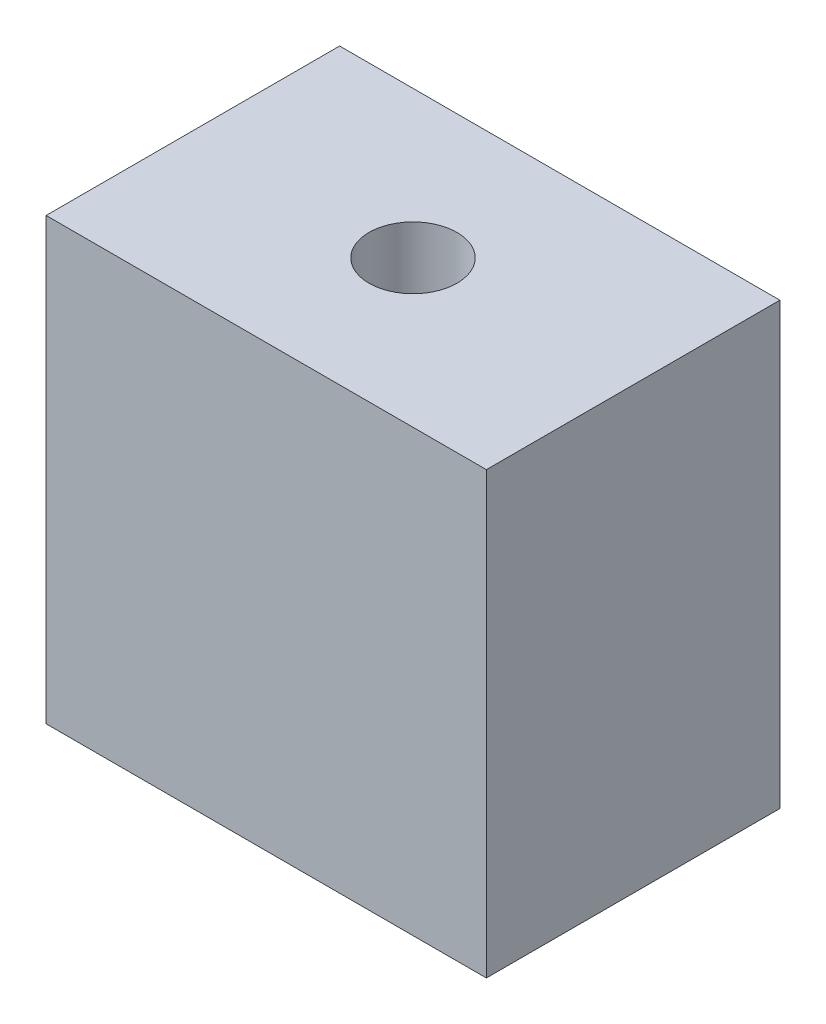
ISO-10303-21;
HEADER;
FILE_DESCRIPTION(('STEP AP214'),'2;1');
FILE_NAME('part.step','',(''),(''),'','','');
FILE_SCHEMA(('AUTOMOTIVE_DESIGN { 1 0 10303 214 1 1 1 1 }'));
ENDSEC;
DATA;
#1=APPLICATION_CONTEXT('core data for automotive mechanical design processes');
#2=APPLICATION_PROTOCOL_DEFINITION('international standard','automotive_design',2000,#1);
#3=PRODUCT_CONTEXT('',#1,'mechanical');
#4=PRODUCT('Part','Part','',(#3));
#5=PRODUCT_RELATED_PRODUCT_CATEGORY('part','',(#4));
#6=PRODUCT_DEFINITION_FORMATION('','',#4);
#7=PRODUCT_DEFINITION_CONTEXT('part definition',#1,'design');
#8=PRODUCT_DEFINITION('design','',#6,#7);
#9=PRODUCT_DEFINITION_SHAPE('','',#8);
#10=(LENGTH_UNIT() NAMED_UNIT(*) SI_UNIT(.MILLI.,.METRE.));
#11=(NAMED_UNIT(*) PLANE_ANGLE_UNIT() SI_UNIT($,.RADIAN.));
#12=(NAMED_UNIT(*) SI_UNIT($,.STERADIAN.) SOLID_ANGLE_UNIT());
#13=UNCERTAINTY_MEASURE_WITH_UNIT(LENGTH_MEASURE(1.E-05),#10,'distance_accuracy_value','');
#14=(GEOMETRIC_REPRESENTATION_CONTEXT(3) GLOBAL_UNCERTAINTY_ASSIGNED_CONTEXT((#13)) GLOBAL_UNIT_ASSIGNED_CONTEXT((#10,
#11,#12)) REPRESENTATION_CONTEXT('',''));
#15=CARTESIAN_POINT('',(0.,0.,0.));
#16=DIRECTION('',(0.,0.,1.));
#17=DIRECTION('',(1.,0.,0.));
#18=AXIS2_PLACEMENT_3D('',#15,#16,#17);
#19=CARTESIAN_POINT('',(0.,38.1,0.));
#20=DIRECTION('',(0.,1.,0.));
#21=DIRECTION('',(0.,0.,1.));
#22=AXIS2_PLACEMENT_3D('',#19,#20,#21);
#23=PLANE('',#22);
#24=DIRECTION('',(0.,0.,1.));
#25=VECTOR('',#24,1.);
#26=CARTESIAN_POINT('',(-38.1,38.1,-25.4));
#27=LINE('',#26,#25);
#28=CARTESIAN_POINT('',(-38.1,38.1,-25.4));
#29=VERTEX_POINT('',#28);
#30=CARTESIAN_POINT('',(-38.1,38.1,0.));
#31=VERTEX_POINT('',#30);
#32=EDGE_CURVE('E92',#29,#31,#27,.T.);
#33=ORIENTED_EDGE('',*,*,#32,.T.);
#34=DIRECTION('',(1.,0.,0.));
#35=VECTOR('',#34,1.);
#36=CARTESIAN_POINT('',(-38.1,38.1,0.));
#37=LINE('',#36,#35);
#38=CARTESIAN_POINT('',(0.,38.1,0.));
#39=VERTEX_POINT('',#38);
#40=EDGE_CURVE('E87',#31,#39,#37,.T.);
#41=ORIENTED_EDGE('',*,*,#40,.T.);
#42=DIRECTION('',(0.,0.,-1.));
#43=VECTOR('',#42,1.);
#44=CARTESIAN_POINT('',(0.,38.1,-25.4));
#45=LINE('',#44,#43);
#46=CARTESIAN_POINT('',(0.,38.1,-25.4));
#47=VERTEX_POINT('',#46);
#48=EDGE_CURVE('E90',#39,#47,#45,.T.);
#49=ORIENTED_EDGE('',*,*,#48,.T.);
#50=DIRECTION('',(-1.,0.,0.));
#51=VECTOR('',#50,1.);
#52=CARTESIAN_POINT('',(-38.1,38.1,-25.4));
#53=LINE('',#52,#51);
#54=EDGE_CURVE('E57',#47,#29,#53,.T.);
#55=ORIENTED_EDGE('',*,*,#54,.T.);
#56=EDGE_LOOP('',(#33,#41,#49,#55));
#57=FACE_BOUND('',#56,.T.);
#58=CARTESIAN_POINT('',(-19.05,38.1,-12.7));
#59=DIRECTION('',(0.,1.,0.));
#60=DIRECTION('',(0.,0.,1.));
#61=AXIS2_PLACEMENT_3D('',#58,#59,#60);
#62=CIRCLE('',#61,3.81);
#63=CARTESIAN_POINT('',(-19.05,38.1,-8.89));
#64=VERTEX_POINT('',#63);
#65=EDGE_CURVE('E112',#64,#64,#62,.T.);
#66=ORIENTED_EDGE('',*,*,#65,.F.);
#67=EDGE_LOOP('',(#66));
#68=FACE_BOUND('',#67,.T.);
#69=ADVANCED_FACE('F39',(#57,#68),#23,.T.);
#70=CARTESIAN_POINT('',(0.,0.,0.));
#71=DIRECTION('',(0.,1.,0.));
#72=DIRECTION('',(0.,0.,1.));
#73=AXIS2_PLACEMENT_3D('',#70,#71,#72);
#74=PLANE('',#73);
#75=DIRECTION('',(0.,0.,1.));
#76=VECTOR('',#75,1.);
#77=CARTESIAN_POINT('',(-38.1,0.,-25.4));
#78=LINE('',#77,#76);
#79=CARTESIAN_POINT('',(-38.1,0.,-25.4));
#80=VERTEX_POINT('',#79);
#81=CARTESIAN_POINT('',(-38.1,0.,0.));
#82=VERTEX_POINT('',#81);
#83=EDGE_CURVE('E108',#80,#82,#78,.T.);
#84=ORIENTED_EDGE('',*,*,#83,.F.);
#85=DIRECTION('',(-1.,0.,0.));
#86=VECTOR('',#85,1.);
#87=CARTESIAN_POINT('',(-38.1,0.,-25.4));
#88=LINE('',#87,#86);
#89=CARTESIAN_POINT('',(0.,0.,-25.4));
#90=VERTEX_POINT('',#89);
#91=EDGE_CURVE('E80',#90,#80,#88,.T.);
#92=ORIENTED_EDGE('',*,*,#91,.F.);
#93=DIRECTION('',(0.,0.,-1.));
#94=VECTOR('',#93,1.);
#95=CARTESIAN_POINT('',(0.,0.,-25.4));
#96=LINE('',#95,#94);
#97=CARTESIAN_POINT('',(0.,0.,0.));
#98=VERTEX_POINT('',#97);
#99=EDGE_CURVE('E74',#98,#90,#96,.T.);
#100=ORIENTED_EDGE('',*,*,#99,.F.);
#101=DIRECTION('',(1.,0.,0.));
#102=VECTOR('',#101,1.);
#103=CARTESIAN_POINT('',(-38.1,0.,0.));
#104=LINE('',#103,#102);
#105=EDGE_CURVE('E97',#82,#98,#104,.T.);
#106=ORIENTED_EDGE('',*,*,#105,.F.);
#107=EDGE_LOOP('',(#84,#92,#100,#106));
#108=FACE_BOUND('',#107,.T.);
#109=CARTESIAN_POINT('',(-19.05,0.,-12.7));
#110=DIRECTION('',(0.,1.,0.));
#111=DIRECTION('',(0.,0.,1.));
#112=AXIS2_PLACEMENT_3D('',#109,#110,#111);
#113=CIRCLE('',#112,3.81);
#114=CARTESIAN_POINT('',(-19.05,0.,-8.89));
#115=VERTEX_POINT('',#114);
#116=EDGE_CURVE('E130',#115,#115,#113,.T.);
#117=ORIENTED_EDGE('',*,*,#116,.T.);
#118=EDGE_LOOP('',(#117));
#119=FACE_BOUND('',#118,.T.);
#120=ADVANCED_FACE('F125',(#108,#119),#74,.F.);
#121=CARTESIAN_POINT('',(-38.1,38.1,-25.4));
#122=DIRECTION('',(1.,0.,0.));
#123=DIRECTION('',(0.,0.,-1.));
#124=AXIS2_PLACEMENT_3D('',#121,#122,#123);
#125=PLANE('',#124);
#126=ORIENTED_EDGE('',*,*,#83,.T.);
#127=DIRECTION('',(0.,-1.,0.));
#128=VECTOR('',#127,1.);
#129=CARTESIAN_POINT('',(-38.1,38.1,0.));
#130=LINE('',#129,#128);
#131=EDGE_CURVE('E11',#31,#82,#130,.T.);
#132=ORIENTED_EDGE('',*,*,#131,.F.);
#133=ORIENTED_EDGE('',*,*,#32,.F.);
#134=DIRECTION('',(0.,-1.,0.));
#135=VECTOR('',#134,1.);
#136=CARTESIAN_POINT('',(-38.1,38.1,-25.4));
#137=LINE('',#136,#135);
#138=EDGE_CURVE('E104',#29,#80,#137,.T.);
#139=ORIENTED_EDGE('',*,*,#138,.T.);
#140=EDGE_LOOP('',(#126,#132,#133,#139));
#141=FACE_BOUND('',#140,.T.);
#142=ADVANCED_FACE('F41',(#141),#125,.F.);
#143=CARTESIAN_POINT('',(-38.1,38.1,0.));
#144=DIRECTION('',(0.,0.,-1.));
#145=DIRECTION('',(-1.,0.,0.));
#146=AXIS2_PLACEMENT_3D('',#143,#144,#145);
#147=PLANE('',#146);
#148=ORIENTED_EDGE('',*,*,#105,.T.);
#149=DIRECTION('',(0.,-1.,0.));
#150=VECTOR('',#149,1.);
#151=CARTESIAN_POINT('',(0.,38.1,0.));
#152=LINE('',#151,#150);
#153=EDGE_CURVE('E49',#39,#98,#152,.T.);
#154=ORIENTED_EDGE('',*,*,#153,.F.);
#155=ORIENTED_EDGE('',*,*,#40,.F.);
#156=ORIENTED_EDGE('',*,*,#131,.T.);
#157=EDGE_LOOP('',(#148,#154,#155,#156));
#158=FACE_BOUND('',#157,.T.);
#159=ADVANCED_FACE('F96',(#158),#147,.F.);
#160=CARTESIAN_POINT('',(0.,38.1,-25.4));
#161=DIRECTION('',(-1.,0.,0.));
#162=DIRECTION('',(0.,0.,1.));
#163=AXIS2_PLACEMENT_3D('',#160,#161,#162);
#164=PLANE('',#163);
#165=ORIENTED_EDGE('',*,*,#99,.T.);
#166=DIRECTION('',(0.,-1.,0.));
#167=VECTOR('',#166,1.);
#168=CARTESIAN_POINT('',(0.,38.1,-25.4));
#169=LINE('',#168,#167);
#170=EDGE_CURVE('E99',#47,#90,#169,.T.);
#171=ORIENTED_EDGE('',*,*,#170,.F.);
#172=ORIENTED_EDGE('',*,*,#48,.F.);
#173=ORIENTED_EDGE('',*,*,#153,.T.);
#174=EDGE_LOOP('',(#165,#171,#172,#173));
#175=FACE_BOUND('',#174,.T.);
#176=ADVANCED_FACE('F100',(#175),#164,.F.);
#177=CARTESIAN_POINT('',(-38.1,38.1,-25.4));
#178=DIRECTION('',(0.,0.,1.));
#179=DIRECTION('',(1.,0.,0.));
#180=AXIS2_PLACEMENT_3D('',#177,#178,#179);
#181=PLANE('',#180);
#182=ORIENTED_EDGE('',*,*,#91,.T.);
#183=ORIENTED_EDGE('',*,*,#138,.F.);
#184=ORIENTED_EDGE('',*,*,#54,.F.);
#185=ORIENTED_EDGE('',*,*,#170,.T.);
#186=EDGE_LOOP('',(#182,#183,#184,#185));
#187=FACE_BOUND('',#186,.T.);
#188=ADVANCED_FACE('F122',(#187),#181,.F.);
#189=CARTESIAN_POINT('',(-19.05,38.1,-12.7));
#190=DIRECTION('',(0.,-1.,0.));
#191=DIRECTION('',(0.,0.,-1.));
#192=AXIS2_PLACEMENT_3D('',#189,#190,#191);
#193=CYLINDRICAL_SURFACE('',#192,3.81);
#194=ORIENTED_EDGE('',*,*,#65,.T.);
#195=EDGE_LOOP('',(#194));
#196=FACE_BOUND('',#195,.T.);
#197=ORIENTED_EDGE('',*,*,#116,.F.);
#198=EDGE_LOOP('',(#197));
#199=FACE_BOUND('',#198,.T.);
#200=ADVANCED_FACE('F138',(#196,#199),#193,.F.);
#201=CLOSED_SHELL('',(#69,#120,#142,#159,#176,#188,#200));
#202=MANIFOLD_SOLID_BREP('B2',#201);
#203=ADVANCED_BREP_SHAPE_REPRESENTATION('',(#18,#202),#14);
#204=SHAPE_DEFINITION_REPRESENTATION(#9,#203);
ENDSEC;
END-ISO-10303-21;
